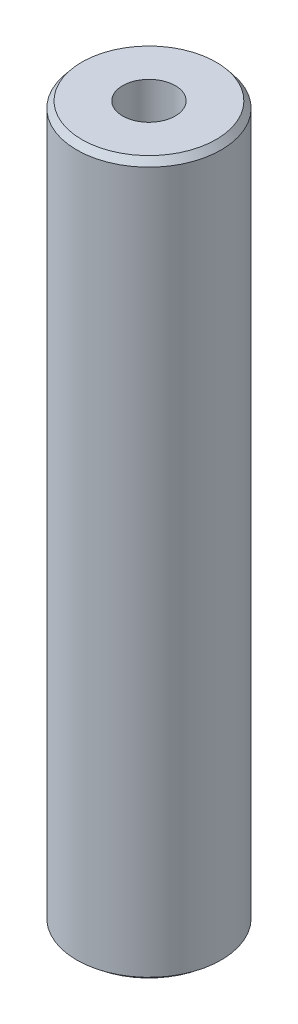
ISO-10303-21;
HEADER;
FILE_DESCRIPTION(('STEP AP214'),'2;1');
FILE_NAME('part.step','',(''),(''),'','','');
FILE_SCHEMA(('AUTOMOTIVE_DESIGN { 1 0 10303 214 1 1 1 1 }'));
ENDSEC;
DATA;
#1=APPLICATION_CONTEXT('core data for automotive mechanical design processes');
#2=APPLICATION_PROTOCOL_DEFINITION('international standard','automotive_design',2000,#1);
#3=PRODUCT_CONTEXT('',#1,'mechanical');
#4=PRODUCT('Part','Part','',(#3));
#5=PRODUCT_RELATED_PRODUCT_CATEGORY('part','',(#4));
#6=PRODUCT_DEFINITION_FORMATION('','',#4);
#7=PRODUCT_DEFINITION_CONTEXT('part definition',#1,'design');
#8=PRODUCT_DEFINITION('design','',#6,#7);
#9=PRODUCT_DEFINITION_SHAPE('','',#8);
#10=(LENGTH_UNIT() NAMED_UNIT(*) SI_UNIT(.MILLI.,.METRE.));
#11=(NAMED_UNIT(*) PLANE_ANGLE_UNIT() SI_UNIT($,.RADIAN.));
#12=(NAMED_UNIT(*) SI_UNIT($,.STERADIAN.) SOLID_ANGLE_UNIT());
#13=UNCERTAINTY_MEASURE_WITH_UNIT(LENGTH_MEASURE(1.E-05),#10,'distance_accuracy_value','');
#14=(GEOMETRIC_REPRESENTATION_CONTEXT(3) GLOBAL_UNCERTAINTY_ASSIGNED_CONTEXT((#13)) GLOBAL_UNIT_ASSIGNED_CONTEXT((#10,
#11,#12)) REPRESENTATION_CONTEXT('',''));
#15=CARTESIAN_POINT('',(0.,0.,0.));
#16=DIRECTION('',(0.,0.,1.));
#17=DIRECTION('',(1.,0.,0.));
#18=AXIS2_PLACEMENT_3D('',#15,#16,#17);
#19=CARTESIAN_POINT('',(0.,567.393684621758,0.));
#20=DIRECTION('',(0.,-1.,0.));
#21=DIRECTION('',(0.,0.,-1.));
#22=AXIS2_PLACEMENT_3D('',#19,#20,#21);
#23=CYLINDRICAL_SURFACE('',#22,57.5);
#24=CARTESIAN_POINT('',(0.,562.293637888566,0.));
#25=DIRECTION('',(0.,1.,0.));
#26=DIRECTION('',(0.,0.,1.));
#27=AXIS2_PLACEMENT_3D('',#24,#25,#26);
#28=CIRCLE('',#27,57.5);
#29=CARTESIAN_POINT('',(0.,562.293637888566,57.5));
#30=VERTEX_POINT('',#29);
#31=EDGE_CURVE('E50',#30,#30,#28,.F.);
#32=ORIENTED_EDGE('',*,*,#31,.T.);
#33=EDGE_LOOP('',(#32));
#34=FACE_BOUND('',#33,.T.);
#35=CARTESIAN_POINT('',(0.,4.08359271769332,0.));
#36=DIRECTION('',(0.,1.,0.));
#37=DIRECTION('',(0.,0.,1.));
#38=AXIS2_PLACEMENT_3D('',#35,#36,#37);
#39=CIRCLE('',#38,57.5);
#40=CARTESIAN_POINT('',(0.,4.08359271769332,57.5));
#41=VERTEX_POINT('',#40);
#42=EDGE_CURVE('E51',#41,#41,#39,.T.);
#43=ORIENTED_EDGE('',*,*,#42,.T.);
#44=EDGE_LOOP('',(#43));
#45=FACE_BOUND('',#44,.T.);
#46=ADVANCED_FACE('F39',(#34,#45),#23,.T.);
#47=CARTESIAN_POINT('',(0.,567.393684621758,0.));
#48=DIRECTION('',(0.,1.,0.));
#49=DIRECTION('',(0.,0.,1.));
#50=AXIS2_PLACEMENT_3D('',#47,#48,#49);
#51=PLANE('',#50);
#52=CARTESIAN_POINT('',(0.,567.393684621758,0.));
#53=DIRECTION('',(0.,1.,0.));
#54=DIRECTION('',(0.,0.,1.));
#55=AXIS2_PLACEMENT_3D('',#52,#53,#54);
#56=CIRCLE('',#55,53.4164072823066);
#57=CARTESIAN_POINT('',(0.,567.393684621758,53.4164072823066));
#58=VERTEX_POINT('',#57);
#59=EDGE_CURVE('E54',#58,#58,#56,.T.);
#60=ORIENTED_EDGE('',*,*,#59,.T.);
#61=EDGE_LOOP('',(#60));
#62=FACE_BOUND('',#61,.T.);
#63=CARTESIAN_POINT('',(0.,567.393684621758,0.));
#64=DIRECTION('',(0.,1.,0.));
#65=DIRECTION('',(0.,0.,1.));
#66=AXIS2_PLACEMENT_3D('',#63,#64,#65);
#67=CIRCLE('',#66,20.945175142434);
#68=CARTESIAN_POINT('',(0.,567.393684621758,20.945175142434));
#69=VERTEX_POINT('',#68);
#70=EDGE_CURVE('E58',#69,#69,#67,.T.);
#71=ORIENTED_EDGE('',*,*,#70,.F.);
#72=EDGE_LOOP('',(#71));
#73=FACE_BOUND('',#72,.T.);
#74=ADVANCED_FACE('F69',(#62,#73),#51,.T.);
#75=CARTESIAN_POINT('',(0.,0.,0.));
#76=DIRECTION('',(0.,1.,0.));
#77=DIRECTION('',(0.,0.,1.));
#78=AXIS2_PLACEMENT_3D('',#75,#76,#77);
#79=PLANE('',#78);
#80=CARTESIAN_POINT('',(0.,0.,0.));
#81=DIRECTION('',(0.,1.,0.));
#82=DIRECTION('',(0.,0.,1.));
#83=AXIS2_PLACEMENT_3D('',#80,#81,#82);
#84=CIRCLE('',#83,52.399953266808);
#85=CARTESIAN_POINT('',(0.,0.,52.399953266808));
#86=VERTEX_POINT('',#85);
#87=EDGE_CURVE('E10',#86,#86,#84,.F.);
#88=ORIENTED_EDGE('',*,*,#87,.T.);
#89=EDGE_LOOP('',(#88));
#90=FACE_BOUND('',#89,.T.);
#91=CARTESIAN_POINT('',(0.,0.,0.));
#92=DIRECTION('',(0.,1.,0.));
#93=DIRECTION('',(0.,0.,1.));
#94=AXIS2_PLACEMENT_3D('',#91,#92,#93);
#95=CIRCLE('',#94,20.945175142434);
#96=CARTESIAN_POINT('',(0.,0.,20.945175142434));
#97=VERTEX_POINT('',#96);
#98=EDGE_CURVE('E63',#97,#97,#95,.T.);
#99=ORIENTED_EDGE('',*,*,#98,.T.);
#100=EDGE_LOOP('',(#99));
#101=FACE_BOUND('',#100,.T.);
#102=ADVANCED_FACE('F75',(#90,#101),#79,.F.);
#103=CARTESIAN_POINT('',(0.,567.393684621758,0.));
#104=DIRECTION('',(0.,-1.,0.));
#105=DIRECTION('',(0.,0.,-1.));
#106=AXIS2_PLACEMENT_3D('',#103,#104,#105);
#107=CYLINDRICAL_SURFACE('',#106,20.945175142434);
#108=ORIENTED_EDGE('',*,*,#70,.T.);
#109=EDGE_LOOP('',(#108));
#110=FACE_BOUND('',#109,.T.);
#111=ORIENTED_EDGE('',*,*,#98,.F.);
#112=EDGE_LOOP('',(#111));
#113=FACE_BOUND('',#112,.T.);
#114=ADVANCED_FACE('F70',(#110,#113),#107,.F.);
#115=CARTESIAN_POINT('',(0.,567.393684621758,0.));
#116=DIRECTION('',(0.,-1.,0.));
#117=DIRECTION('',(0.,0.,-1.));
#118=AXIS2_PLACEMENT_3D('',#115,#116,#117);
#119=CONICAL_SURFACE('',#118,53.4164072823066,0.675165869262442);
#120=ORIENTED_EDGE('',*,*,#31,.F.);
#121=EDGE_LOOP('',(#120));
#122=FACE_BOUND('',#121,.T.);
#123=ORIENTED_EDGE('',*,*,#59,.F.);
#124=EDGE_LOOP('',(#123));
#125=FACE_BOUND('',#124,.T.);
#126=ADVANCED_FACE('F81',(#122,#125),#119,.T.);
#127=CARTESIAN_POINT('',(0.,4.08359271769332,0.));
#128=DIRECTION('',(0.,1.,0.));
#129=DIRECTION('',(0.,0.,1.));
#130=AXIS2_PLACEMENT_3D('',#127,#128,#129);
#131=CONICAL_SURFACE('',#130,57.5,0.89563045753246);
#132=ORIENTED_EDGE('',*,*,#87,.F.);
#133=EDGE_LOOP('',(#132));
#134=FACE_BOUND('',#133,.T.);
#135=ORIENTED_EDGE('',*,*,#42,.F.);
#136=EDGE_LOOP('',(#135));
#137=FACE_BOUND('',#136,.T.);
#138=ADVANCED_FACE('F45',(#134,#137),#131,.T.);
#139=CLOSED_SHELL('',(#46,#74,#102,#114,#126,#138));
#140=MANIFOLD_SOLID_BREP('B2',#139);
#141=ADVANCED_BREP_SHAPE_REPRESENTATION('',(#18,#140),#14);
#142=SHAPE_DEFINITION_REPRESENTATION(#9,#141);
ENDSEC;
END-ISO-10303-21;
